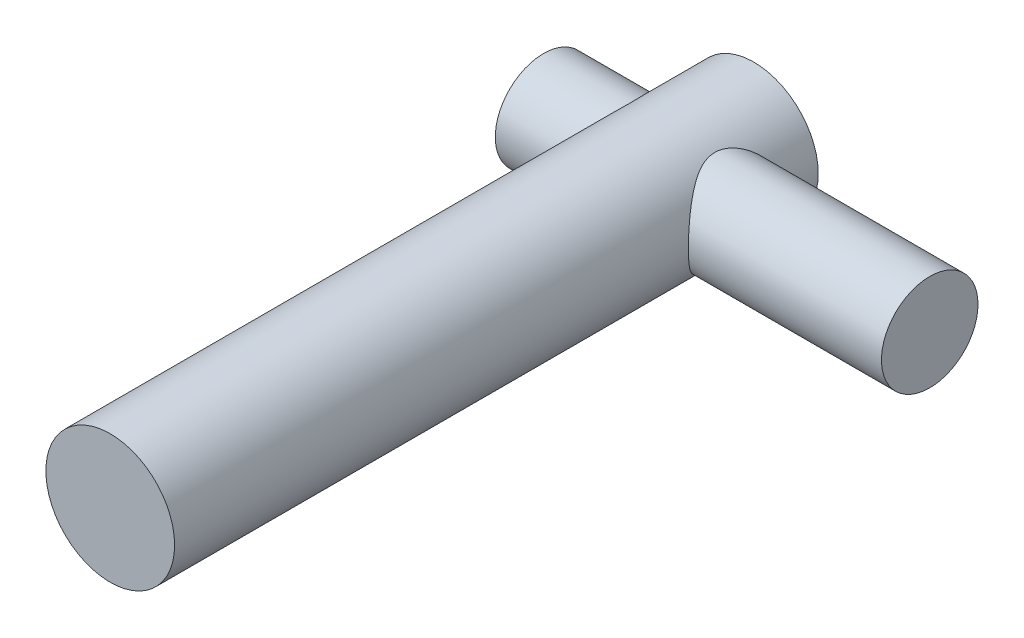
ISO-10303-21;
HEADER;
FILE_DESCRIPTION(('STEP AP214'),'2;1');
FILE_NAME('part.step','',(''),(''),'','','');
FILE_SCHEMA(('AUTOMOTIVE_DESIGN { 1 0 10303 214 1 1 1 1 }'));
ENDSEC;
DATA;
#1=APPLICATION_CONTEXT('core data for automotive mechanical design processes');
#2=APPLICATION_PROTOCOL_DEFINITION('international standard','automotive_design',2000,#1);
#3=PRODUCT_CONTEXT('',#1,'mechanical');
#4=PRODUCT('Part','Part','',(#3));
#5=PRODUCT_RELATED_PRODUCT_CATEGORY('part','',(#4));
#6=PRODUCT_DEFINITION_FORMATION('','',#4);
#7=PRODUCT_DEFINITION_CONTEXT('part definition',#1,'design');
#8=PRODUCT_DEFINITION('design','',#6,#7);
#9=PRODUCT_DEFINITION_SHAPE('','',#8);
#10=(LENGTH_UNIT() NAMED_UNIT(*) SI_UNIT(.MILLI.,.METRE.));
#11=(NAMED_UNIT(*) PLANE_ANGLE_UNIT() SI_UNIT($,.RADIAN.));
#12=(NAMED_UNIT(*) SI_UNIT($,.STERADIAN.) SOLID_ANGLE_UNIT());
#13=UNCERTAINTY_MEASURE_WITH_UNIT(LENGTH_MEASURE(1.E-05),#10,'distance_accuracy_value','');
#14=(GEOMETRIC_REPRESENTATION_CONTEXT(3) GLOBAL_UNCERTAINTY_ASSIGNED_CONTEXT((#13)) GLOBAL_UNIT_ASSIGNED_CONTEXT((#10,
#11,#12)) REPRESENTATION_CONTEXT('',''));
#15=CARTESIAN_POINT('',(0.,0.,0.));
#16=DIRECTION('',(0.,0.,1.));
#17=DIRECTION('',(1.,0.,0.));
#18=AXIS2_PLACEMENT_3D('',#15,#16,#17);
#19=CARTESIAN_POINT('',(0.,0.,-100.));
#20=DIRECTION('',(0.,0.,1.));
#21=DIRECTION('',(1.,0.,0.));
#22=AXIS2_PLACEMENT_3D('',#19,#20,#21);
#23=CYLINDRICAL_SURFACE('',#22,10.);
#24=CARTESIAN_POINT('',(10.,0.,-94.8235532998524));
#25=CARTESIAN_POINT('',(9.99999825220043,0.183148360631225,-94.8235514887898));
#26=CARTESIAN_POINT('',(9.99495621731442,0.366342585140466,-94.8168323434061));
#27=CARTESIAN_POINT('',(9.97490143097507,0.73128464780465,-94.7900608353247));
#28=CARTESIAN_POINT('',(9.95988271339075,0.91303155459935,-94.7700004944837));
#29=CARTESIAN_POINT('',(9.9201917868147,1.27389276294165,-94.7168285465503));
#30=CARTESIAN_POINT('',(9.89550118322144,1.45300136929128,-94.6836920695476));
#31=CARTESIAN_POINT('',(9.83702172640045,1.8069893726824,-94.6048782676881));
#32=CARTESIAN_POINT('',(9.80322881221237,1.98186684397495,-94.5591953451046));
#33=CARTESIAN_POINT('',(9.72752378128582,2.32506995293138,-94.4562896215441));
#34=CARTESIAN_POINT('',(9.6856665671512,2.49343113760904,-94.3991447523363));
#35=CARTESIAN_POINT('',(9.59451489400363,2.82395570771372,-94.2738449627701));
#36=CARTESIAN_POINT('',(9.5452174929203,2.98611660943025,-94.2056856862313));
#37=CARTESIAN_POINT('',(9.38756843011347,3.46192400316673,-93.9859054328298));
#38=CARTESIAN_POINT('',(9.26935773011459,3.76534217699648,-93.818845457296));
#39=CARTESIAN_POINT('',(9.00247083181558,4.36738031046615,-93.4322240070034));
#40=CARTESIAN_POINT('',(8.85198712189838,4.66295396944977,-93.2092333049414));
#41=CARTESIAN_POINT('',(8.53832916588274,5.21514803427102,-92.7260574353363));
#42=CARTESIAN_POINT('',(8.37513550772825,5.47170701559806,-92.4658148437313));
#43=CARTESIAN_POINT('',(8.1123054849366,5.84983236323795,-92.0222140516172));
#44=CARTESIAN_POINT('',(8.01322272061777,5.9844869954101,-91.849477121795));
#45=CARTESIAN_POINT('',(7.81692237304354,6.23870842573755,-91.4920813700963));
#46=CARTESIAN_POINT('',(7.71970535968097,6.35827067422418,-91.3074189784729));
#47=CARTESIAN_POINT('',(7.53024443396407,6.58155279088789,-90.9265821625385));
#48=CARTESIAN_POINT('',(7.43799561146133,6.68528849377296,-90.7304195201372));
#49=CARTESIAN_POINT('',(7.26194992595441,6.87611265864528,-90.3267103819402));
#50=CARTESIAN_POINT('',(7.1781482641012,6.96321059804278,-90.1191704542553));
#51=CARTESIAN_POINT('',(6.99885956719934,7.14400878104047,-89.6260997522407));
#52=CARTESIAN_POINT('',(6.90787299159519,7.23130376139036,-89.336424281847));
#53=CARTESIAN_POINT('',(6.79582705692466,7.33616747091052,-88.8900835758989));
#54=CARTESIAN_POINT('',(6.76256264952769,7.3667656360235,-88.7394206131997));
#55=CARTESIAN_POINT('',(6.70541097180995,7.4188248680279,-88.4348016313902));
#56=CARTESIAN_POINT('',(6.68151886959136,7.44029064361236,-88.2808473524062));
#57=CARTESIAN_POINT('',(6.6439948735184,7.47381957747951,-87.9691686271832));
#58=CARTESIAN_POINT('',(6.63046224230683,7.48579180837433,-87.8114222877455));
#59=CARTESIAN_POINT('',(6.61471013710173,7.4997148121382,-87.4949197227286));
#60=CARTESIAN_POINT('',(6.61249035269243,7.50166585998079,-87.3361635249786));
#61=CARTESIAN_POINT('',(6.61948621008,7.49549374588535,-87.0190462540442));
#62=CARTESIAN_POINT('',(6.62870559451457,7.48736728681515,-86.8606853271727));
#63=CARTESIAN_POINT('',(6.65809333447628,7.46124382754023,-86.5458465054491));
#64=CARTESIAN_POINT('',(6.67826180155519,7.44324672677112,-86.3893686297985));
#65=CARTESIAN_POINT('',(6.74840995476555,7.37988631197294,-85.9578036128428));
#66=CARTESIAN_POINT('',(6.80936438102532,7.32413018954155,-85.6859477328307));
#67=CARTESIAN_POINT('',(6.95570310792851,7.18527767988215,-85.1562825445687));
#68=CARTESIAN_POINT('',(7.04111087930063,7.10215501424416,-84.8984870160494));
#69=CARTESIAN_POINT('',(7.21099153900676,6.92917382263757,-84.4453838165911));
#70=CARTESIAN_POINT('',(7.29266351327927,6.84346833605326,-84.2473938759884));
#71=CARTESIAN_POINT('',(7.46342165901277,6.65682611972851,-83.8619723167324));
#72=CARTESIAN_POINT('',(7.5525116222897,6.55588157861581,-83.6745461810292));
#73=CARTESIAN_POINT('',(7.73517823120312,6.33933222593358,-83.3100894638675));
#74=CARTESIAN_POINT('',(7.82876380678445,6.22369741624749,-83.133081270123));
#75=CARTESIAN_POINT('',(8.01761553681545,5.97844426893638,-82.7900504156998));
#76=CARTESIAN_POINT('',(8.11288142581882,5.84882812374305,-82.6240260392026));
#77=CARTESIAN_POINT('',(8.30521453319945,5.57247402890017,-82.2991983479365));
#78=CARTESIAN_POINT('',(8.4022664993602,5.42538639972573,-82.1406832046141));
#79=CARTESIAN_POINT('',(8.59350313157059,5.11709028531977,-81.836082006718));
#80=CARTESIAN_POINT('',(8.68768750660851,4.95588037331083,-81.6899972109312));
#81=CARTESIAN_POINT('',(8.87089324795421,4.61993509999968,-81.4113847182716));
#82=CARTESIAN_POINT('',(8.95992308307119,4.44522309293501,-81.2788344939018));
#83=CARTESIAN_POINT('',(9.13090472642981,4.08249343487891,-81.0281728016998));
#84=CARTESIAN_POINT('',(9.21285834099645,3.89447920193419,-80.9100576458552));
#85=CARTESIAN_POINT('',(9.35211813533671,3.54483535127365,-80.7117426773047));
#86=CARTESIAN_POINT('',(9.41107137526017,3.38547499880141,-80.6286893210598));
#87=CARTESIAN_POINT('',(9.52211460031246,3.0592491085992,-80.4734724214342));
#88=CARTESIAN_POINT('',(9.57420599638373,2.89238512327236,-80.4013066388897));
#89=CARTESIAN_POINT('',(9.67052015896568,2.55192522953367,-80.2686942235219));
#90=CARTESIAN_POINT('',(9.71474587063951,2.37833187059298,-80.2082432035551));
#91=CARTESIAN_POINT('',(9.7944303324846,2.0253079733789,-80.09982730147));
#92=CARTESIAN_POINT('',(9.82988897006302,1.84587736017293,-80.0518625797091));
#93=CARTESIAN_POINT('',(9.89142668215868,1.48124003999792,-79.968887977025));
#94=CARTESIAN_POINT('',(9.91744578882848,1.29600425567116,-79.9339608829392));
#95=CARTESIAN_POINT('',(9.95915423278582,0.922276966538743,-79.8780781935215));
#96=CARTESIAN_POINT('',(9.97484354492046,0.733785453806588,-79.8571226322101));
#97=CARTESIAN_POINT('',(9.99548555303477,0.355230498112988,-79.8295680551114));
#98=CARTESIAN_POINT('',(10.0004418293711,0.165167600582674,-79.822964251821));
#99=CARTESIAN_POINT('',(9.99949640206274,-0.214874139571313,-79.8242247060756));
#100=CARTESIAN_POINT('',(9.99359555401241,-0.40485298763841,-79.8320878235566));
#101=CARTESIAN_POINT('',(9.97223305994797,-0.763928127056919,-79.8606109301145));
#102=CARTESIAN_POINT('',(9.95779618888371,-0.933197305435483,-79.8798996418451));
#103=CARTESIAN_POINT('',(9.92057133553495,-1.26918880187071,-79.9297713493685));
#104=CARTESIAN_POINT('',(9.89778056893783,-1.43591025146061,-79.9603581107724));
#105=CARTESIAN_POINT('',(9.84430767733922,-1.76564432096826,-80.0323959504311));
#106=CARTESIAN_POINT('',(9.81362747999547,-1.92865783628605,-80.0738443748572));
#107=CARTESIAN_POINT('',(9.74493618777163,-2.25016822648629,-80.1671033771377));
#108=CARTESIAN_POINT('',(9.70692222377836,-2.40866330572276,-80.2189180107507));
#109=CARTESIAN_POINT('',(9.62279034107678,-2.72575422161847,-80.3342966562168));
#110=CARTESIAN_POINT('',(9.57643622072002,-2.88416117889076,-80.3982071257447));
#111=CARTESIAN_POINT('',(9.47738924248976,-3.19463271777294,-80.5358303507596));
#112=CARTESIAN_POINT('',(9.42469423001768,-3.34669511976835,-80.6095464390414));
#113=CARTESIAN_POINT('',(9.25839398463924,-3.79243668836605,-80.8443463756757));
#114=CARTESIAN_POINT('',(9.13650809547068,-4.0759094224292,-81.0191702700079));
#115=CARTESIAN_POINT('',(8.85592689861201,-4.65763303463207,-81.4325144241187));
#116=CARTESIAN_POINT('',(8.69448369509786,-4.95044606090116,-81.676796315386));
#117=CARTESIAN_POINT('',(8.44516881462102,-5.35767107336566,-82.0717680032805));
#118=CARTESIAN_POINT('',(8.36074234741945,-5.48824918209259,-82.2084060856901));
#119=CARTESIAN_POINT('',(8.19100904652956,-5.73848345968049,-82.4908125875819));
#120=CARTESIAN_POINT('',(8.10570242630511,-5.85814221058998,-82.6365788347516));
#121=CARTESIAN_POINT('',(7.91961196391863,-6.1080614484982,-82.9655696994672));
#122=CARTESIAN_POINT('',(7.81897317293293,-6.23600392340882,-83.1506427232536));
#123=CARTESIAN_POINT('',(7.62168627596285,-6.47564568677309,-83.5331753475043));
#124=CARTESIAN_POINT('',(7.52503964549598,-6.58733900727103,-83.7306394610217));
#125=CARTESIAN_POINT('',(7.33958950470875,-6.79334858159908,-84.1372931555655));
#126=CARTESIAN_POINT('',(7.25076782174859,-6.88770568215122,-84.3464536197376));
#127=CARTESIAN_POINT('',(7.08503810393456,-7.05807032553022,-84.7765845807844));
#128=CARTESIAN_POINT('',(7.00812021113291,-7.13409308112477,-84.9975450994063));
#129=CARTESIAN_POINT('',(6.89776536900086,-7.24045739920369,-85.3622898797553));
#130=CARTESIAN_POINT('',(6.85905105065737,-7.27706722475708,-85.5026746504304));
#131=CARTESIAN_POINT('',(6.78909215619299,-7.34237828490355,-85.7870798675454));
#132=CARTESIAN_POINT('',(6.75784495867725,-7.37108229544017,-85.9310990184175));
#133=CARTESIAN_POINT('',(6.70397772845788,-7.4201086614118,-86.2218804462942));
#134=CARTESIAN_POINT('',(6.68134175721601,-7.44044650753221,-86.3686371227913));
#135=CARTESIAN_POINT('',(6.64553659947692,-7.47244433482208,-86.6642555121216));
#136=CARTESIAN_POINT('',(6.63236743689915,-7.48410429406541,-86.8131172302724));
#137=CARTESIAN_POINT('',(6.6160439268707,-7.49853887636309,-87.1125989133255));
#138=CARTESIAN_POINT('',(6.61294157310427,-7.50126737026042,-87.2632239865165));
#139=CARTESIAN_POINT('',(6.6170441038311,-7.49764855771468,-87.5642183708537));
#140=CARTESIAN_POINT('',(6.62424877171269,-7.49130144200401,-87.7145876873084));
#141=CARTESIAN_POINT('',(6.64864042221953,-7.46966150960368,-88.0139936386925));
#142=CARTESIAN_POINT('',(6.66583653866428,-7.45436050750459,-88.1630289273522));
#143=CARTESIAN_POINT('',(6.70947271822502,-7.41510828933918,-88.4586403371077));
#144=CARTESIAN_POINT('',(6.73591768435147,-7.39115248495674,-88.6052151105555));
#145=CARTESIAN_POINT('',(6.80366991769712,-7.32888993758966,-88.9265718629026));
#146=CARTESIAN_POINT('',(6.84695911424572,-7.2885946670903,-89.1005508613039));
#147=CARTESIAN_POINT('',(6.9436074963383,-7.19657956576837,-89.4426727151038));
#148=CARTESIAN_POINT('',(6.99697427787175,-7.14485111212705,-89.6108110541759));
#149=CARTESIAN_POINT('',(7.11173285585201,-7.03063417120003,-89.9409481442842));
#150=CARTESIAN_POINT('',(7.17314049085417,-6.96812436806887,-90.1029339418533));
#151=CARTESIAN_POINT('',(7.30189696957415,-6.83308175773699,-90.4201159415982));
#152=CARTESIAN_POINT('',(7.36924400073341,-6.76055200457876,-90.5753141936872));
#153=CARTESIAN_POINT('',(7.53227527340474,-6.57908862155702,-90.9316388922126));
#154=CARTESIAN_POINT('',(7.62967949604614,-6.46625899136203,-91.1300022595425));
#155=CARTESIAN_POINT('',(7.82848797542238,-6.22409397674893,-91.5142876916228));
#156=CARTESIAN_POINT('',(7.92989347166993,-6.09475344941422,-91.7002058522392));
#157=CARTESIAN_POINT('',(8.13368678615596,-5.82000166017293,-92.0594531173658));
#158=CARTESIAN_POINT('',(8.23607528693575,-5.6745783636291,-92.2327726314593));
#159=CARTESIAN_POINT('',(8.43902615179916,-5.36811116429772,-92.5661322322175));
#160=CARTESIAN_POINT('',(8.53958873605844,-5.20706915992246,-92.7261739283892));
#161=CARTESIAN_POINT('',(8.73722404742755,-4.86823444610668,-93.0334598720288));
#162=CARTESIAN_POINT('',(8.83426032912377,-4.69031229919782,-93.1805852239882));
#163=CARTESIAN_POINT('',(9.02148209885813,-4.31926384766125,-93.4593332916493));
#164=CARTESIAN_POINT('',(9.11166669061666,-4.12613556060168,-93.5909539803989));
#165=CARTESIAN_POINT('',(9.28256253574139,-3.72576429558786,-93.8369064651168));
#166=CARTESIAN_POINT('',(9.36329167565036,-3.51854917893226,-93.951271026068));
#167=CARTESIAN_POINT('',(9.51304471510835,-3.09083237545735,-94.1612013516256));
#168=CARTESIAN_POINT('',(9.58207465305381,-2.87033762289901,-94.2567768180872));
#169=CARTESIAN_POINT('',(9.68796526126722,-2.48412405824607,-94.402279722599));
#170=CARTESIAN_POINT('',(9.72832482945905,-2.32129005811084,-94.4573762913406));
#171=CARTESIAN_POINT('',(9.80132549603499,-1.9906420118458,-94.5566103396824));
#172=CARTESIAN_POINT('',(9.83396846856479,-1.82282918610053,-94.6007504804235));
#173=CARTESIAN_POINT('',(9.89082818213227,-1.48358839494539,-94.6774053953293));
#174=CARTESIAN_POINT('',(9.91506439962453,-1.31216977477245,-94.7099470453289));
#175=CARTESIAN_POINT('',(9.95469855719796,-0.966540401338069,-94.763065258849));
#176=CARTESIAN_POINT('',(9.9701010169854,-0.792331122875256,-94.7836479411294));
#177=CARTESIAN_POINT('',(9.98726751877774,-0.514835906933083,-94.8065701014355));
#178=CARTESIAN_POINT('',(9.99203792739739,-0.412044960462375,-94.8129344517196));
#179=CARTESIAN_POINT('',(9.9984049153868,-0.206174215981061,-94.8214269016253));
#180=CARTESIAN_POINT('',(10.0000009838379,-0.103094374145227,-94.8235543193012));
#181=CARTESIAN_POINT('',(10.,0.,-94.8235532998524));
#182=B_SPLINE_CURVE_WITH_KNOTS('',3,(#24,#25,#26,#27,#28,#29,#30,#31,#32,#33,#34,#35,#36,#37,
#38,#39,#40,#41,#42,#43,#44,#45,#46,#47,#48,#49,#50,#51,#52,#53,#54,#55,#56,#57,#58,#59,#60,#61,
#62,#63,#64,#65,#66,#67,#68,#69,#70,#71,#72,#73,#74,#75,#76,#77,#78,#79,#80,#81,#82,#83,#84,#85,
#86,#87,#88,#89,#90,#91,#92,#93,#94,#95,#96,#97,#98,#99,#100,#101,#102,#103,#104,#105,#106,#107,
#108,#109,#110,#111,#112,#113,#114,#115,#116,#117,#118,#119,#120,#121,#122,#123,#124,#125,#126,
#127,#128,#129,#130,#131,#132,#133,#134,#135,#136,#137,#138,#139,#140,#141,#142,#143,#144,#145,
#146,#147,#148,#149,#150,#151,#152,#153,#154,#155,#156,#157,#158,#159,#160,#161,#162,#163,#164,
#165,#166,#167,#168,#169,#170,#171,#172,#173,#174,#175,#176,#177,#178,#179,#180,#181),
.UNSPECIFIED.,.T.,.F.,(4,2,2,2,2,2,2,2,2,2,2,2,2,2,2,2,2,2,2,2,2,2,2,2,2,2,2,2,2,2,2,2,2,2,2,2,
2,2,2,2,2,2,2,2,2,2,2,2,2,2,2,2,2,2,2,2,2,2,2,2,2,2,2,2,2,2,2,2,2,2,2,2,2,2,2,2,2,2,4),(0.,
0.549333810396352,1.09899642261334,1.64970953325451,2.20066875053375,2.74800168216963,
3.29555161528972,4.38923194166927,5.58419151329429,6.78101336768093,7.50152042078937,
8.22224415798695,8.9422420029002,9.66182848258841,10.6057257062583,11.0771415311411,
11.5483139968762,12.0239465220089,12.4995659960823,12.9753411231469,13.4511210976087,
14.3000658907337,15.1498282626303,15.8409837223713,16.5324946713612,17.2254411215002,
17.9182790673241,18.6286106705283,19.3390141216436,20.0482151836289,20.7572346715093,
21.3240789510858,21.8908064927599,22.4573213847599,23.0238435519584,23.5939042031105,
24.163966242347,24.7338380893511,25.3036650295947,25.8159956353882,26.3284971539712,
26.8408735696906,27.3534508450853,27.8838865184233,28.4145029424249,29.474953667118,
30.7125000722884,31.3331067040452,31.9535662015579,32.6921380168985,33.4309804122228,
34.1680590123691,34.9045239072426,35.3546199278827,35.8045577056811,36.2536585931602,
36.7027606153632,37.1541785263258,37.6055869504597,38.0574086864992,38.5094703067445,
39.0599080061887,39.6107622667341,40.1627183763173,40.7145066214402,41.4578805109441,
42.201486518752,42.9456527762347,43.6897286953818,44.4400598679721,45.1904890240894,
45.9394748739469,46.6880729590087,47.2172824489514,47.7463632763239,48.2742100312629,
48.8017864770611,49.1109572068325,49.420177694444),.UNSPECIFIED.);
#183=CARTESIAN_POINT('',(10.,0.,-94.8235532998524));
#184=VERTEX_POINT('',#183);
#185=EDGE_CURVE('E10',#184,#184,#182,.T.);
#186=ORIENTED_EDGE('',*,*,#185,.F.);
#187=EDGE_LOOP('',(#186));
#188=FACE_BOUND('',#187,.T.);
#189=CARTESIAN_POINT('',(-10.,0.,-94.8235532998524));
#190=CARTESIAN_POINT('',(-9.99999825220043,-0.183148360631225,-94.8235514887898));
#191=CARTESIAN_POINT('',(-9.99495621731442,-0.366342585140466,-94.8168323434061));
#192=CARTESIAN_POINT('',(-9.97490143097507,-0.73128464780465,-94.7900608353247));
#193=CARTESIAN_POINT('',(-9.95988271339075,-0.91303155459935,-94.7700004944837));
#194=CARTESIAN_POINT('',(-9.9201917868147,-1.27389276294165,-94.7168285465503));
#195=CARTESIAN_POINT('',(-9.89550118322144,-1.45300136929128,-94.6836920695476));
#196=CARTESIAN_POINT('',(-9.83702172640045,-1.8069893726824,-94.6048782676881));
#197=CARTESIAN_POINT('',(-9.80322881221237,-1.98186684397495,-94.5591953451046));
#198=CARTESIAN_POINT('',(-9.72752378128582,-2.32506995293138,-94.4562896215441));
#199=CARTESIAN_POINT('',(-9.6856665671512,-2.49343113760904,-94.3991447523363));
#200=CARTESIAN_POINT('',(-9.59451489400363,-2.82395570771372,-94.2738449627701));
#201=CARTESIAN_POINT('',(-9.5452174929203,-2.98611660943025,-94.2056856862313));
#202=CARTESIAN_POINT('',(-9.38756843011347,-3.46192400316673,-93.9859054328298));
#203=CARTESIAN_POINT('',(-9.26935773011459,-3.76534217699648,-93.818845457296));
#204=CARTESIAN_POINT('',(-9.00247083181558,-4.36738031046615,-93.4322240070034));
#205=CARTESIAN_POINT('',(-8.85198712189838,-4.66295396944977,-93.2092333049414));
#206=CARTESIAN_POINT('',(-8.53832916588274,-5.21514803427102,-92.7260574353363));
#207=CARTESIAN_POINT('',(-8.37513550772825,-5.47170701559806,-92.4658148437313));
#208=CARTESIAN_POINT('',(-8.1123054849366,-5.84983236323795,-92.0222140516172));
#209=CARTESIAN_POINT('',(-8.01322272061777,-5.9844869954101,-91.849477121795));
#210=CARTESIAN_POINT('',(-7.81692237304354,-6.23870842573755,-91.4920813700963));
#211=CARTESIAN_POINT('',(-7.71970535968097,-6.35827067422418,-91.3074189784729));
#212=CARTESIAN_POINT('',(-7.53024443396407,-6.58155279088789,-90.9265821625385));
#213=CARTESIAN_POINT('',(-7.43799561146133,-6.68528849377296,-90.7304195201372));
#214=CARTESIAN_POINT('',(-7.26194992595441,-6.87611265864528,-90.3267103819402));
#215=CARTESIAN_POINT('',(-7.1781482641012,-6.96321059804278,-90.1191704542553));
#216=CARTESIAN_POINT('',(-6.99885956719934,-7.14400878104047,-89.6260997522407));
#217=CARTESIAN_POINT('',(-6.90787299159519,-7.23130376139036,-89.336424281847));
#218=CARTESIAN_POINT('',(-6.79582705692466,-7.33616747091052,-88.8900835758989));
#219=CARTESIAN_POINT('',(-6.76256264952769,-7.3667656360235,-88.7394206131997));
#220=CARTESIAN_POINT('',(-6.70541097180995,-7.4188248680279,-88.4348016313902));
#221=CARTESIAN_POINT('',(-6.68151886959136,-7.44029064361236,-88.2808473524062));
#222=CARTESIAN_POINT('',(-6.6439948735184,-7.47381957747951,-87.9691686271832));
#223=CARTESIAN_POINT('',(-6.63046224230683,-7.48579180837433,-87.8114222877455));
#224=CARTESIAN_POINT('',(-6.61471013710173,-7.4997148121382,-87.4949197227286));
#225=CARTESIAN_POINT('',(-6.61249035269243,-7.50166585998079,-87.3361635249786));
#226=CARTESIAN_POINT('',(-6.61948621008,-7.49549374588535,-87.0190462540442));
#227=CARTESIAN_POINT('',(-6.62870559451457,-7.48736728681515,-86.8606853271727));
#228=CARTESIAN_POINT('',(-6.65809333447628,-7.46124382754023,-86.5458465054491));
#229=CARTESIAN_POINT('',(-6.67826180155519,-7.44324672677112,-86.3893686297985));
#230=CARTESIAN_POINT('',(-6.74840995476555,-7.37988631197294,-85.9578036128428));
#231=CARTESIAN_POINT('',(-6.80936438102532,-7.32413018954155,-85.6859477328307));
#232=CARTESIAN_POINT('',(-6.95570310792851,-7.18527767988215,-85.1562825445687));
#233=CARTESIAN_POINT('',(-7.04111087930063,-7.10215501424416,-84.8984870160494));
#234=CARTESIAN_POINT('',(-7.21099153900676,-6.92917382263757,-84.4453838165911));
#235=CARTESIAN_POINT('',(-7.29266351327927,-6.84346833605326,-84.2473938759884));
#236=CARTESIAN_POINT('',(-7.46342165901277,-6.65682611972851,-83.8619723167324));
#237=CARTESIAN_POINT('',(-7.5525116222897,-6.55588157861581,-83.6745461810292));
#238=CARTESIAN_POINT('',(-7.73517823120312,-6.33933222593358,-83.3100894638675));
#239=CARTESIAN_POINT('',(-7.82876380678445,-6.22369741624749,-83.133081270123));
#240=CARTESIAN_POINT('',(-8.01761553681545,-5.97844426893638,-82.7900504156998));
#241=CARTESIAN_POINT('',(-8.11288142581882,-5.84882812374305,-82.6240260392026));
#242=CARTESIAN_POINT('',(-8.30521453319945,-5.57247402890017,-82.2991983479365));
#243=CARTESIAN_POINT('',(-8.4022664993602,-5.42538639972573,-82.1406832046141));
#244=CARTESIAN_POINT('',(-8.59350313157059,-5.11709028531977,-81.836082006718));
#245=CARTESIAN_POINT('',(-8.68768750660851,-4.95588037331083,-81.6899972109312));
#246=CARTESIAN_POINT('',(-8.87089324795421,-4.61993509999968,-81.4113847182716));
#247=CARTESIAN_POINT('',(-8.95992308307119,-4.44522309293501,-81.2788344939018));
#248=CARTESIAN_POINT('',(-9.13090472642981,-4.08249343487891,-81.0281728016998));
#249=CARTESIAN_POINT('',(-9.21285834099645,-3.89447920193419,-80.9100576458552));
#250=CARTESIAN_POINT('',(-9.35211813533671,-3.54483535127365,-80.7117426773047));
#251=CARTESIAN_POINT('',(-9.41107137526017,-3.38547499880141,-80.6286893210598));
#252=CARTESIAN_POINT('',(-9.52211460031246,-3.0592491085992,-80.4734724214342));
#253=CARTESIAN_POINT('',(-9.57420599638373,-2.89238512327236,-80.4013066388897));
#254=CARTESIAN_POINT('',(-9.67052015896568,-2.55192522953367,-80.2686942235219));
#255=CARTESIAN_POINT('',(-9.71474587063951,-2.37833187059298,-80.2082432035551));
#256=CARTESIAN_POINT('',(-9.7944303324846,-2.0253079733789,-80.09982730147));
#257=CARTESIAN_POINT('',(-9.82988897006302,-1.84587736017293,-80.0518625797091));
#258=CARTESIAN_POINT('',(-9.89142668215868,-1.48124003999792,-79.968887977025));
#259=CARTESIAN_POINT('',(-9.91744578882848,-1.29600425567116,-79.9339608829392));
#260=CARTESIAN_POINT('',(-9.95915423278582,-0.922276966538743,-79.8780781935215));
#261=CARTESIAN_POINT('',(-9.97484354492046,-0.733785453806588,-79.8571226322101));
#262=CARTESIAN_POINT('',(-9.99548555303477,-0.355230498112988,-79.8295680551114));
#263=CARTESIAN_POINT('',(-10.0004418293711,-0.165167600582674,-79.822964251821));
#264=CARTESIAN_POINT('',(-9.99949640206274,0.214874139571313,-79.8242247060756));
#265=CARTESIAN_POINT('',(-9.99359555401241,0.40485298763841,-79.8320878235566));
#266=CARTESIAN_POINT('',(-9.97223305994797,0.763928127056919,-79.8606109301145));
#267=CARTESIAN_POINT('',(-9.95779618888371,0.933197305435483,-79.8798996418451));
#268=CARTESIAN_POINT('',(-9.92057133553495,1.26918880187071,-79.9297713493685));
#269=CARTESIAN_POINT('',(-9.89778056893783,1.43591025146061,-79.9603581107724));
#270=CARTESIAN_POINT('',(-9.84430767733922,1.76564432096826,-80.0323959504311));
#271=CARTESIAN_POINT('',(-9.81362747999547,1.92865783628605,-80.0738443748572));
#272=CARTESIAN_POINT('',(-9.74493618777163,2.25016822648629,-80.1671033771377));
#273=CARTESIAN_POINT('',(-9.70692222377836,2.40866330572276,-80.2189180107507));
#274=CARTESIAN_POINT('',(-9.62279034107678,2.72575422161847,-80.3342966562168));
#275=CARTESIAN_POINT('',(-9.57643622072002,2.88416117889076,-80.3982071257447));
#276=CARTESIAN_POINT('',(-9.47738924248976,3.19463271777294,-80.5358303507596));
#277=CARTESIAN_POINT('',(-9.42469423001768,3.34669511976835,-80.6095464390414));
#278=CARTESIAN_POINT('',(-9.25839398463924,3.79243668836605,-80.8443463756757));
#279=CARTESIAN_POINT('',(-9.13650809547068,4.0759094224292,-81.0191702700079));
#280=CARTESIAN_POINT('',(-8.85592689861201,4.65763303463207,-81.4325144241187));
#281=CARTESIAN_POINT('',(-8.69448369509786,4.95044606090116,-81.676796315386));
#282=CARTESIAN_POINT('',(-8.44516881462102,5.35767107336566,-82.0717680032805));
#283=CARTESIAN_POINT('',(-8.36074234741945,5.48824918209259,-82.2084060856901));
#284=CARTESIAN_POINT('',(-8.19100904652956,5.73848345968049,-82.4908125875819));
#285=CARTESIAN_POINT('',(-8.10570242630511,5.85814221058998,-82.6365788347516));
#286=CARTESIAN_POINT('',(-7.91961196391863,6.1080614484982,-82.9655696994672));
#287=CARTESIAN_POINT('',(-7.81897317293293,6.23600392340882,-83.1506427232536));
#288=CARTESIAN_POINT('',(-7.62168627596285,6.47564568677309,-83.5331753475043));
#289=CARTESIAN_POINT('',(-7.52503964549598,6.58733900727103,-83.7306394610217));
#290=CARTESIAN_POINT('',(-7.33958950470875,6.79334858159908,-84.1372931555655));
#291=CARTESIAN_POINT('',(-7.25076782174859,6.88770568215122,-84.3464536197376));
#292=CARTESIAN_POINT('',(-7.08503810393456,7.05807032553022,-84.7765845807844));
#293=CARTESIAN_POINT('',(-7.00812021113291,7.13409308112477,-84.9975450994063));
#294=CARTESIAN_POINT('',(-6.89776536900086,7.24045739920369,-85.3622898797553));
#295=CARTESIAN_POINT('',(-6.85905105065737,7.27706722475708,-85.5026746504304));
#296=CARTESIAN_POINT('',(-6.78909215619299,7.34237828490355,-85.7870798675454));
#297=CARTESIAN_POINT('',(-6.75784495867725,7.37108229544017,-85.9310990184175));
#298=CARTESIAN_POINT('',(-6.70397772845788,7.4201086614118,-86.2218804462942));
#299=CARTESIAN_POINT('',(-6.68134175721601,7.44044650753221,-86.3686371227913));
#300=CARTESIAN_POINT('',(-6.64553659947692,7.47244433482208,-86.6642555121216));
#301=CARTESIAN_POINT('',(-6.63236743689915,7.48410429406541,-86.8131172302724));
#302=CARTESIAN_POINT('',(-6.6160439268707,7.49853887636309,-87.1125989133255));
#303=CARTESIAN_POINT('',(-6.61294157310427,7.50126737026042,-87.2632239865165));
#304=CARTESIAN_POINT('',(-6.6170441038311,7.49764855771468,-87.5642183708537));
#305=CARTESIAN_POINT('',(-6.62424877171269,7.49130144200401,-87.7145876873084));
#306=CARTESIAN_POINT('',(-6.64864042221953,7.46966150960368,-88.0139936386925));
#307=CARTESIAN_POINT('',(-6.66583653866428,7.45436050750459,-88.1630289273522));
#308=CARTESIAN_POINT('',(-6.70947271822502,7.41510828933918,-88.4586403371077));
#309=CARTESIAN_POINT('',(-6.73591768435147,7.39115248495674,-88.6052151105555));
#310=CARTESIAN_POINT('',(-6.80366991769712,7.32888993758966,-88.9265718629026));
#311=CARTESIAN_POINT('',(-6.84695911424572,7.2885946670903,-89.1005508613039));
#312=CARTESIAN_POINT('',(-6.9436074963383,7.19657956576837,-89.4426727151038));
#313=CARTESIAN_POINT('',(-6.99697427787175,7.14485111212705,-89.6108110541759));
#314=CARTESIAN_POINT('',(-7.11173285585201,7.03063417120003,-89.9409481442842));
#315=CARTESIAN_POINT('',(-7.17314049085417,6.96812436806887,-90.1029339418533));
#316=CARTESIAN_POINT('',(-7.30189696957415,6.83308175773699,-90.4201159415982));
#317=CARTESIAN_POINT('',(-7.36924400073341,6.76055200457876,-90.5753141936872));
#318=CARTESIAN_POINT('',(-7.53227527340474,6.57908862155702,-90.9316388922126));
#319=CARTESIAN_POINT('',(-7.62967949604614,6.46625899136203,-91.1300022595425));
#320=CARTESIAN_POINT('',(-7.82848797542238,6.22409397674893,-91.5142876916228));
#321=CARTESIAN_POINT('',(-7.92989347166993,6.09475344941422,-91.7002058522392));
#322=CARTESIAN_POINT('',(-8.13368678615596,5.82000166017293,-92.0594531173658));
#323=CARTESIAN_POINT('',(-8.23607528693575,5.6745783636291,-92.2327726314593));
#324=CARTESIAN_POINT('',(-8.43902615179916,5.36811116429772,-92.5661322322175));
#325=CARTESIAN_POINT('',(-8.53958873605844,5.20706915992246,-92.7261739283892));
#326=CARTESIAN_POINT('',(-8.73722404742755,4.86823444610668,-93.0334598720288));
#327=CARTESIAN_POINT('',(-8.83426032912377,4.69031229919782,-93.1805852239882));
#328=CARTESIAN_POINT('',(-9.02148209885813,4.31926384766125,-93.4593332916493));
#329=CARTESIAN_POINT('',(-9.11166669061666,4.12613556060168,-93.5909539803989));
#330=CARTESIAN_POINT('',(-9.28256253574139,3.72576429558786,-93.8369064651168));
#331=CARTESIAN_POINT('',(-9.36329167565036,3.51854917893226,-93.951271026068));
#332=CARTESIAN_POINT('',(-9.51304471510835,3.09083237545735,-94.1612013516256));
#333=CARTESIAN_POINT('',(-9.58207465305381,2.87033762289901,-94.2567768180872));
#334=CARTESIAN_POINT('',(-9.68796526126722,2.48412405824607,-94.402279722599));
#335=CARTESIAN_POINT('',(-9.72832482945905,2.32129005811084,-94.4573762913406));
#336=CARTESIAN_POINT('',(-9.80132549603499,1.9906420118458,-94.5566103396824));
#337=CARTESIAN_POINT('',(-9.83396846856479,1.82282918610053,-94.6007504804235));
#338=CARTESIAN_POINT('',(-9.89082818213227,1.48358839494539,-94.6774053953293));
#339=CARTESIAN_POINT('',(-9.91506439962453,1.31216977477245,-94.7099470453289));
#340=CARTESIAN_POINT('',(-9.95469855719796,0.966540401338069,-94.763065258849));
#341=CARTESIAN_POINT('',(-9.9701010169854,0.792331122875256,-94.7836479411294));
#342=CARTESIAN_POINT('',(-9.98726751877774,0.514835906933083,-94.8065701014355));
#343=CARTESIAN_POINT('',(-9.99203792739739,0.412044960462375,-94.8129344517196));
#344=CARTESIAN_POINT('',(-9.9984049153868,0.206174215981061,-94.8214269016253));
#345=CARTESIAN_POINT('',(-10.0000009838379,0.103094374145227,-94.8235543193012));
#346=CARTESIAN_POINT('',(-10.,0.,-94.8235532998524));
#347=B_SPLINE_CURVE_WITH_KNOTS('',3,(#189,#190,#191,#192,#193,#194,#195,#196,#197,#198,#199,
#200,#201,#202,#203,#204,#205,#206,#207,#208,#209,#210,#211,#212,#213,#214,#215,#216,#217,#218,
#219,#220,#221,#222,#223,#224,#225,#226,#227,#228,#229,#230,#231,#232,#233,#234,#235,#236,#237,
#238,#239,#240,#241,#242,#243,#244,#245,#246,#247,#248,#249,#250,#251,#252,#253,#254,#255,#256,
#257,#258,#259,#260,#261,#262,#263,#264,#265,#266,#267,#268,#269,#270,#271,#272,#273,#274,#275,
#276,#277,#278,#279,#280,#281,#282,#283,#284,#285,#286,#287,#288,#289,#290,#291,#292,#293,#294,
#295,#296,#297,#298,#299,#300,#301,#302,#303,#304,#305,#306,#307,#308,#309,#310,#311,#312,#313,
#314,#315,#316,#317,#318,#319,#320,#321,#322,#323,#324,#325,#326,#327,#328,#329,#330,#331,#332,
#333,#334,#335,#336,#337,#338,#339,#340,#341,#342,#343,#344,#345,#346),.UNSPECIFIED.,.T.,.F.,(4,
2,2,2,2,2,2,2,2,2,2,2,2,2,2,2,2,2,2,2,2,2,2,2,2,2,2,2,2,2,2,2,2,2,2,2,2,2,2,2,2,2,2,2,2,2,2,2,2,
2,2,2,2,2,2,2,2,2,2,2,2,2,2,2,2,2,2,2,2,2,2,2,2,2,2,2,2,2,4),(0.,0.549333810396352,
1.09899642261334,1.64970953325451,2.20066875053375,2.74800168216963,3.29555161528972,
4.38923194166927,5.58419151329429,6.78101336768093,7.50152042078937,8.22224415798695,
8.9422420029002,9.66182848258841,10.6057257062583,11.0771415311411,11.5483139968762,
12.0239465220089,12.4995659960823,12.9753411231469,13.4511210976087,14.3000658907337,
15.1498282626303,15.8409837223713,16.5324946713612,17.2254411215002,17.9182790673241,
18.6286106705283,19.3390141216436,20.0482151836289,20.7572346715093,21.3240789510858,
21.8908064927599,22.4573213847599,23.0238435519584,23.5939042031105,24.163966242347,
24.7338380893511,25.3036650295947,25.8159956353882,26.3284971539712,26.8408735696906,
27.3534508450853,27.8838865184233,28.4145029424249,29.474953667118,30.7125000722884,
31.3331067040452,31.9535662015579,32.6921380168985,33.4309804122228,34.1680590123691,
34.9045239072426,35.3546199278827,35.8045577056811,36.2536585931602,36.7027606153632,
37.1541785263258,37.6055869504597,38.0574086864992,38.5094703067445,39.0599080061887,
39.6107622667341,40.1627183763173,40.7145066214402,41.4578805109441,42.201486518752,
42.9456527762347,43.6897286953818,44.4400598679721,45.1904890240894,45.9394748739469,
46.6880729590087,47.2172824489514,47.7463632763239,48.2742100312629,48.8017864770611,
49.1109572068325,49.420177694444),.UNSPECIFIED.);
#348=CARTESIAN_POINT('',(-10.,0.,-94.8235532998524));
#349=VERTEX_POINT('',#348);
#350=EDGE_CURVE('E53',#349,#349,#347,.T.);
#351=ORIENTED_EDGE('',*,*,#350,.F.);
#352=EDGE_LOOP('',(#351));
#353=FACE_BOUND('',#352,.T.);
#354=CARTESIAN_POINT('',(0.,0.,-100.));
#355=DIRECTION('',(0.,0.,1.));
#356=DIRECTION('',(1.,0.,0.));
#357=AXIS2_PLACEMENT_3D('',#354,#355,#356);
#358=CIRCLE('',#357,10.);
#359=CARTESIAN_POINT('',(10.,0.,-100.));
#360=VERTEX_POINT('',#359);
#361=EDGE_CURVE('E58',#360,#360,#358,.T.);
#362=ORIENTED_EDGE('',*,*,#361,.T.);
#363=EDGE_LOOP('',(#362));
#364=FACE_BOUND('',#363,.T.);
#365=CARTESIAN_POINT('',(0.,0.,0.));
#366=DIRECTION('',(0.,0.,1.));
#367=DIRECTION('',(1.,0.,0.));
#368=AXIS2_PLACEMENT_3D('',#365,#366,#367);
#369=CIRCLE('',#368,10.);
#370=CARTESIAN_POINT('',(10.,0.,0.));
#371=VERTEX_POINT('',#370);
#372=EDGE_CURVE('E63',#371,#371,#369,.T.);
#373=ORIENTED_EDGE('',*,*,#372,.F.);
#374=EDGE_LOOP('',(#373));
#375=FACE_BOUND('',#374,.T.);
#376=ADVANCED_FACE('F41',(#188,#353,#364,#375),#23,.T.);
#377=CARTESIAN_POINT('',(0.,0.,-100.));
#378=DIRECTION('',(0.,0.,1.));
#379=DIRECTION('',(1.,0.,0.));
#380=AXIS2_PLACEMENT_3D('',#377,#378,#379);
#381=PLANE('',#380);
#382=ORIENTED_EDGE('',*,*,#361,.F.);
#383=EDGE_LOOP('',(#382));
#384=FACE_BOUND('',#383,.T.);
#385=ADVANCED_FACE('F78',(#384),#381,.F.);
#386=CARTESIAN_POINT('',(0.,0.,0.));
#387=DIRECTION('',(0.,0.,1.));
#388=DIRECTION('',(1.,0.,0.));
#389=AXIS2_PLACEMENT_3D('',#386,#387,#388);
#390=PLANE('',#389);
#391=ORIENTED_EDGE('',*,*,#372,.T.);
#392=EDGE_LOOP('',(#391));
#393=FACE_BOUND('',#392,.T.);
#394=ADVANCED_FACE('F81',(#393),#390,.T.);
#395=CARTESIAN_POINT('',(-20.,0.,-87.3235532998524));
#396=DIRECTION('',(1.,0.,0.));
#397=DIRECTION('',(0.,0.,-1.));
#398=AXIS2_PLACEMENT_3D('',#395,#396,#397);
#399=PLANE('',#398);
#400=CARTESIAN_POINT('',(-20.,0.,-87.3235532998524));
#401=DIRECTION('',(1.,0.,0.));
#402=DIRECTION('',(0.,0.,-1.));
#403=AXIS2_PLACEMENT_3D('',#400,#401,#402);
#404=CIRCLE('',#403,7.50000000000001);
#405=CARTESIAN_POINT('',(-20.,0.,-94.8235532998524));
#406=VERTEX_POINT('',#405);
#407=EDGE_CURVE('E100',#406,#406,#404,.T.);
#408=ORIENTED_EDGE('',*,*,#407,.F.);
#409=EDGE_LOOP('',(#408));
#410=FACE_BOUND('',#409,.T.);
#411=ADVANCED_FACE('F75',(#410),#399,.F.);
#412=CARTESIAN_POINT('',(-20.,0.,-87.3235532998524));
#413=DIRECTION('',(1.,0.,0.));
#414=DIRECTION('',(0.,0.,-1.));
#415=AXIS2_PLACEMENT_3D('',#412,#413,#414);
#416=CYLINDRICAL_SURFACE('',#415,7.50000000000001);
#417=ORIENTED_EDGE('',*,*,#350,.T.);
#418=EDGE_LOOP('',(#417));
#419=FACE_BOUND('',#418,.T.);
#420=ORIENTED_EDGE('',*,*,#407,.T.);
#421=EDGE_LOOP('',(#420));
#422=FACE_BOUND('',#421,.T.);
#423=ADVANCED_FACE('F69',(#419,#422),#416,.T.);
#424=ORIENTED_EDGE('',*,*,#185,.T.);
#425=EDGE_LOOP('',(#424));
#426=FACE_BOUND('',#425,.T.);
#427=CARTESIAN_POINT('',(40.,0.,-87.3235532998524));
#428=DIRECTION('',(1.,0.,0.));
#429=DIRECTION('',(0.,0.,-1.));
#430=AXIS2_PLACEMENT_3D('',#427,#428,#429);
#431=CIRCLE('',#430,7.50000000000001);
#432=CARTESIAN_POINT('',(40.,0.,-94.8235532998524));
#433=VERTEX_POINT('',#432);
#434=EDGE_CURVE('E103',#433,#433,#431,.T.);
#435=ORIENTED_EDGE('',*,*,#434,.F.);
#436=EDGE_LOOP('',(#435));
#437=FACE_BOUND('',#436,.T.);
#438=ADVANCED_FACE('F74',(#426,#437),#416,.T.);
#439=CARTESIAN_POINT('',(40.,0.,-87.3235532998524));
#440=DIRECTION('',(1.,0.,0.));
#441=DIRECTION('',(0.,0.,-1.));
#442=AXIS2_PLACEMENT_3D('',#439,#440,#441);
#443=PLANE('',#442);
#444=ORIENTED_EDGE('',*,*,#434,.T.);
#445=EDGE_LOOP('',(#444));
#446=FACE_BOUND('',#445,.T.);
#447=ADVANCED_FACE('F76',(#446),#443,.T.);
#448=CLOSED_SHELL('',(#376,#385,#394,#411,#423,#438,#447));
#449=MANIFOLD_SOLID_BREP('B2',#448);
#450=ADVANCED_BREP_SHAPE_REPRESENTATION('',(#18,#449),#14);
#451=SHAPE_DEFINITION_REPRESENTATION(#9,#450);
ENDSEC;
END-ISO-10303-21;
